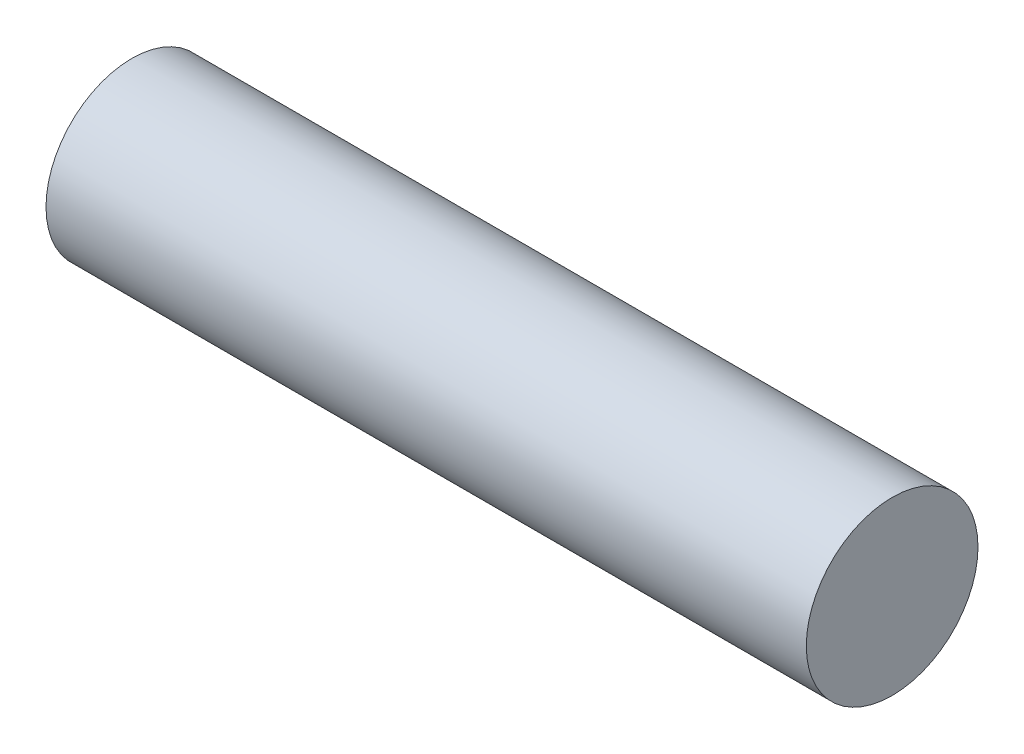
ISO-10303-21;
HEADER;
FILE_DESCRIPTION(('STEP AP214'),'2;1');
FILE_NAME('part.step','',(''),(''),'','','');
FILE_SCHEMA(('AUTOMOTIVE_DESIGN { 1 0 10303 214 1 1 1 1 }'));
ENDSEC;
DATA;
#1=APPLICATION_CONTEXT('core data for automotive mechanical design processes');
#2=APPLICATION_PROTOCOL_DEFINITION('international standard','automotive_design',2000,#1);
#3=PRODUCT_CONTEXT('',#1,'mechanical');
#4=PRODUCT('Part','Part','',(#3));
#5=PRODUCT_RELATED_PRODUCT_CATEGORY('part','',(#4));
#6=PRODUCT_DEFINITION_FORMATION('','',#4);
#7=PRODUCT_DEFINITION_CONTEXT('part definition',#1,'design');
#8=PRODUCT_DEFINITION('design','',#6,#7);
#9=PRODUCT_DEFINITION_SHAPE('','',#8);
#10=(LENGTH_UNIT() NAMED_UNIT(*) SI_UNIT(.MILLI.,.METRE.));
#11=(NAMED_UNIT(*) PLANE_ANGLE_UNIT() SI_UNIT($,.RADIAN.));
#12=(NAMED_UNIT(*) SI_UNIT($,.STERADIAN.) SOLID_ANGLE_UNIT());
#13=UNCERTAINTY_MEASURE_WITH_UNIT(LENGTH_MEASURE(1.E-05),#10,'distance_accuracy_value','');
#14=(GEOMETRIC_REPRESENTATION_CONTEXT(3) GLOBAL_UNCERTAINTY_ASSIGNED_CONTEXT((#13)) GLOBAL_UNIT_ASSIGNED_CONTEXT((#10,
#11,#12)) REPRESENTATION_CONTEXT('',''));
#15=CARTESIAN_POINT('',(0.,0.,0.));
#16=DIRECTION('',(0.,0.,1.));
#17=DIRECTION('',(1.,0.,0.));
#18=AXIS2_PLACEMENT_3D('',#15,#16,#17);
#19=CARTESIAN_POINT('',(7.874,0.,0.));
#20=DIRECTION('',(-1.,0.,0.));
#21=DIRECTION('',(0.,0.,1.));
#22=AXIS2_PLACEMENT_3D('',#19,#20,#21);
#23=CYLINDRICAL_SURFACE('',#22,1.778);
#24=CARTESIAN_POINT('',(7.874,0.,0.));
#25=DIRECTION('',(1.,0.,0.));
#26=DIRECTION('',(0.,0.,-1.));
#27=AXIS2_PLACEMENT_3D('',#24,#25,#26);
#28=CIRCLE('',#27,1.778);
#29=CARTESIAN_POINT('',(7.874,0.,-1.778));
#30=VERTEX_POINT('',#29);
#31=EDGE_CURVE('E10',#30,#30,#28,.T.);
#32=ORIENTED_EDGE('',*,*,#31,.F.);
#33=EDGE_LOOP('',(#32));
#34=FACE_BOUND('',#33,.T.);
#35=CARTESIAN_POINT('',(-7.874,0.,0.));
#36=DIRECTION('',(1.,0.,0.));
#37=DIRECTION('',(0.,0.,-1.));
#38=AXIS2_PLACEMENT_3D('',#35,#36,#37);
#39=CIRCLE('',#38,1.778);
#40=CARTESIAN_POINT('',(-7.874,0.,-1.778));
#41=VERTEX_POINT('',#40);
#42=EDGE_CURVE('E35',#41,#41,#39,.T.);
#43=ORIENTED_EDGE('',*,*,#42,.T.);
#44=EDGE_LOOP('',(#43));
#45=FACE_BOUND('',#44,.T.);
#46=ADVANCED_FACE('F32',(#34,#45),#23,.T.);
#47=CARTESIAN_POINT('',(7.874,0.,0.));
#48=DIRECTION('',(1.,0.,0.));
#49=DIRECTION('',(0.,0.,-1.));
#50=AXIS2_PLACEMENT_3D('',#47,#48,#49);
#51=PLANE('',#50);
#52=ORIENTED_EDGE('',*,*,#31,.T.);
#53=EDGE_LOOP('',(#52));
#54=FACE_BOUND('',#53,.T.);
#55=ADVANCED_FACE('F47',(#54),#51,.T.);
#56=CARTESIAN_POINT('',(-7.874,0.,0.));
#57=DIRECTION('',(1.,0.,0.));
#58=DIRECTION('',(0.,0.,-1.));
#59=AXIS2_PLACEMENT_3D('',#56,#57,#58);
#60=PLANE('',#59);
#61=ORIENTED_EDGE('',*,*,#42,.F.);
#62=EDGE_LOOP('',(#61));
#63=FACE_BOUND('',#62,.T.);
#64=ADVANCED_FACE('F45',(#63),#60,.F.);
#65=CLOSED_SHELL('',(#46,#55,#64));
#66=MANIFOLD_SOLID_BREP('B2',#65);
#67=ADVANCED_BREP_SHAPE_REPRESENTATION('',(#18,#66),#14);
#68=SHAPE_DEFINITION_REPRESENTATION(#9,#67);
ENDSEC;
END-ISO-10303-21;
